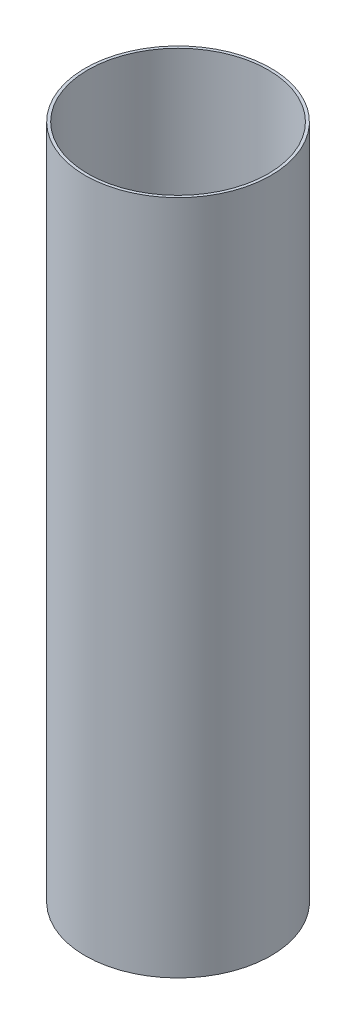
ISO-10303-21;
HEADER;
FILE_DESCRIPTION(('STEP AP214'),'2;1');
FILE_NAME('part.step','',(''),(''),'','','');
FILE_SCHEMA(('AUTOMOTIVE_DESIGN { 1 0 10303 214 1 1 1 1 }'));
ENDSEC;
DATA;
#1=APPLICATION_CONTEXT('core data for automotive mechanical design processes');
#2=APPLICATION_PROTOCOL_DEFINITION('international standard','automotive_design',2000,#1);
#3=PRODUCT_CONTEXT('',#1,'mechanical');
#4=PRODUCT('Part','Part','',(#3));
#5=PRODUCT_RELATED_PRODUCT_CATEGORY('part','',(#4));
#6=PRODUCT_DEFINITION_FORMATION('','',#4);
#7=PRODUCT_DEFINITION_CONTEXT('part definition',#1,'design');
#8=PRODUCT_DEFINITION('design','',#6,#7);
#9=PRODUCT_DEFINITION_SHAPE('','',#8);
#10=(LENGTH_UNIT() NAMED_UNIT(*) SI_UNIT(.MILLI.,.METRE.));
#11=(NAMED_UNIT(*) PLANE_ANGLE_UNIT() SI_UNIT($,.RADIAN.));
#12=(NAMED_UNIT(*) SI_UNIT($,.STERADIAN.) SOLID_ANGLE_UNIT());
#13=UNCERTAINTY_MEASURE_WITH_UNIT(LENGTH_MEASURE(1.E-05),#10,'distance_accuracy_value','');
#14=(GEOMETRIC_REPRESENTATION_CONTEXT(3) GLOBAL_UNCERTAINTY_ASSIGNED_CONTEXT((#13)) GLOBAL_UNIT_ASSIGNED_CONTEXT((#10,
#11,#12)) REPRESENTATION_CONTEXT('',''));
#15=CARTESIAN_POINT('',(0.,0.,0.));
#16=DIRECTION('',(0.,0.,1.));
#17=DIRECTION('',(1.,0.,0.));
#18=AXIS2_PLACEMENT_3D('',#15,#16,#17);
#19=CARTESIAN_POINT('',(0.,762.,0.));
#20=DIRECTION('',(0.,-1.,0.));
#21=DIRECTION('',(0.,0.,-1.));
#22=AXIS2_PLACEMENT_3D('',#19,#20,#21);
#23=CYLINDRICAL_SURFACE('',#22,101.6);
#24=CARTESIAN_POINT('',(0.,762.,0.));
#25=DIRECTION('',(0.,1.,0.));
#26=DIRECTION('',(0.,0.,1.));
#27=AXIS2_PLACEMENT_3D('',#24,#25,#26);
#28=CIRCLE('',#27,101.6);
#29=CARTESIAN_POINT('',(0.,762.,101.6));
#30=VERTEX_POINT('',#29);
#31=EDGE_CURVE('E40',#30,#30,#28,.T.);
#32=ORIENTED_EDGE('',*,*,#31,.T.);
#33=EDGE_LOOP('',(#32));
#34=FACE_BOUND('',#33,.T.);
#35=CARTESIAN_POINT('',(0.,0.,0.));
#36=DIRECTION('',(0.,1.,0.));
#37=DIRECTION('',(0.,0.,1.));
#38=AXIS2_PLACEMENT_3D('',#35,#36,#37);
#39=CIRCLE('',#38,101.6);
#40=CARTESIAN_POINT('',(0.,0.,101.6));
#41=VERTEX_POINT('',#40);
#42=EDGE_CURVE('E46',#41,#41,#39,.T.);
#43=ORIENTED_EDGE('',*,*,#42,.F.);
#44=EDGE_LOOP('',(#43));
#45=FACE_BOUND('',#44,.T.);
#46=ADVANCED_FACE('F33',(#34,#45),#23,.F.);
#47=CARTESIAN_POINT('',(0.,762.,0.));
#48=DIRECTION('',(0.,-1.,0.));
#49=DIRECTION('',(0.,0.,-1.));
#50=AXIS2_PLACEMENT_3D('',#47,#48,#49);
#51=CYLINDRICAL_SURFACE('',#50,104.775);
#52=CARTESIAN_POINT('',(0.,762.,0.));
#53=DIRECTION('',(0.,1.,0.));
#54=DIRECTION('',(0.,0.,1.));
#55=AXIS2_PLACEMENT_3D('',#52,#53,#54);
#56=CIRCLE('',#55,104.775);
#57=CARTESIAN_POINT('',(0.,762.,104.775));
#58=VERTEX_POINT('',#57);
#59=EDGE_CURVE('E10',#58,#58,#56,.T.);
#60=ORIENTED_EDGE('',*,*,#59,.F.);
#61=EDGE_LOOP('',(#60));
#62=FACE_BOUND('',#61,.T.);
#63=CARTESIAN_POINT('',(0.,0.,0.));
#64=DIRECTION('',(0.,1.,0.));
#65=DIRECTION('',(0.,0.,1.));
#66=AXIS2_PLACEMENT_3D('',#63,#64,#65);
#67=CIRCLE('',#66,104.775);
#68=CARTESIAN_POINT('',(0.,0.,104.775));
#69=VERTEX_POINT('',#68);
#70=EDGE_CURVE('E36',#69,#69,#67,.T.);
#71=ORIENTED_EDGE('',*,*,#70,.T.);
#72=EDGE_LOOP('',(#71));
#73=FACE_BOUND('',#72,.T.);
#74=ADVANCED_FACE('F53',(#62,#73),#51,.T.);
#75=CARTESIAN_POINT('',(0.,762.,0.));
#76=DIRECTION('',(0.,1.,0.));
#77=DIRECTION('',(0.,0.,1.));
#78=AXIS2_PLACEMENT_3D('',#75,#76,#77);
#79=PLANE('',#78);
#80=ORIENTED_EDGE('',*,*,#31,.F.);
#81=EDGE_LOOP('',(#80));
#82=FACE_BOUND('',#81,.T.);
#83=ORIENTED_EDGE('',*,*,#59,.T.);
#84=EDGE_LOOP('',(#83));
#85=FACE_BOUND('',#84,.T.);
#86=ADVANCED_FACE('F57',(#82,#85),#79,.T.);
#87=CARTESIAN_POINT('',(0.,0.,0.));
#88=DIRECTION('',(0.,1.,0.));
#89=DIRECTION('',(0.,0.,1.));
#90=AXIS2_PLACEMENT_3D('',#87,#88,#89);
#91=PLANE('',#90);
#92=ORIENTED_EDGE('',*,*,#42,.T.);
#93=EDGE_LOOP('',(#92));
#94=FACE_BOUND('',#93,.T.);
#95=ORIENTED_EDGE('',*,*,#70,.F.);
#96=EDGE_LOOP('',(#95));
#97=FACE_BOUND('',#96,.T.);
#98=ADVANCED_FACE('F55',(#94,#97),#91,.F.);
#99=CLOSED_SHELL('',(#46,#74,#86,#98));
#100=MANIFOLD_SOLID_BREP('B2',#99);
#101=ADVANCED_BREP_SHAPE_REPRESENTATION('',(#18,#100),#14);
#102=SHAPE_DEFINITION_REPRESENTATION(#9,#101);
ENDSEC;
END-ISO-10303-21;
